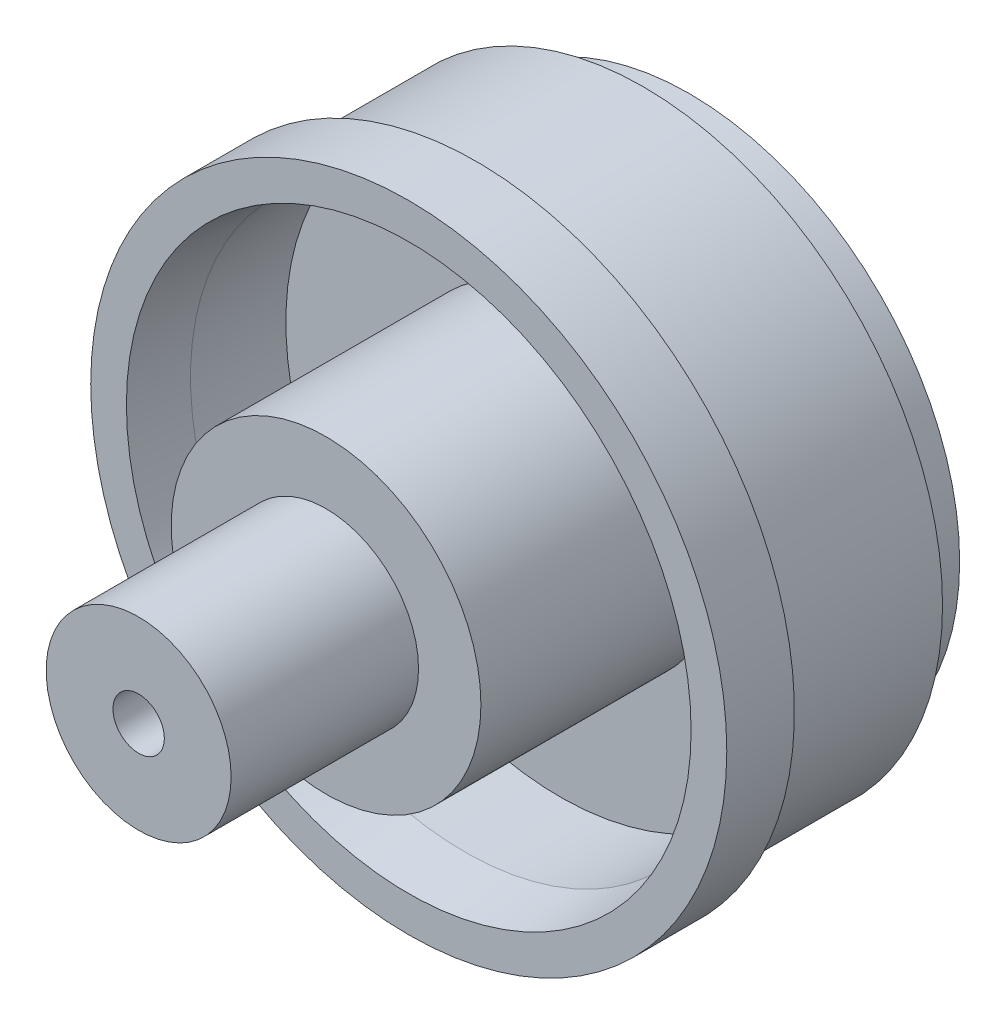
ISO-10303-21;
HEADER;
FILE_DESCRIPTION(('STEP AP214'),'2;1');
FILE_NAME('part.step','',(''),(''),'','','');
FILE_SCHEMA(('AUTOMOTIVE_DESIGN { 1 0 10303 214 1 1 1 1 }'));
ENDSEC;
DATA;
#1=APPLICATION_CONTEXT('core data for automotive mechanical design processes');
#2=APPLICATION_PROTOCOL_DEFINITION('international standard','automotive_design',2000,#1);
#3=PRODUCT_CONTEXT('',#1,'mechanical');
#4=PRODUCT('Part','Part','',(#3));
#5=PRODUCT_RELATED_PRODUCT_CATEGORY('part','',(#4));
#6=PRODUCT_DEFINITION_FORMATION('','',#4);
#7=PRODUCT_DEFINITION_CONTEXT('part definition',#1,'design');
#8=PRODUCT_DEFINITION('design','',#6,#7);
#9=PRODUCT_DEFINITION_SHAPE('','',#8);
#10=(LENGTH_UNIT() NAMED_UNIT(*) SI_UNIT(.MILLI.,.METRE.));
#11=(NAMED_UNIT(*) PLANE_ANGLE_UNIT() SI_UNIT($,.RADIAN.));
#12=(NAMED_UNIT(*) SI_UNIT($,.STERADIAN.) SOLID_ANGLE_UNIT());
#13=UNCERTAINTY_MEASURE_WITH_UNIT(LENGTH_MEASURE(1.E-05),#10,'distance_accuracy_value','');
#14=(GEOMETRIC_REPRESENTATION_CONTEXT(3) GLOBAL_UNCERTAINTY_ASSIGNED_CONTEXT((#13)) GLOBAL_UNIT_ASSIGNED_CONTEXT((#10,
#11,#12)) REPRESENTATION_CONTEXT('',''));
#15=CARTESIAN_POINT('',(0.,0.,0.));
#16=DIRECTION('',(0.,0.,1.));
#17=DIRECTION('',(1.,0.,0.));
#18=AXIS2_PLACEMENT_3D('',#15,#16,#17);
#19=CARTESIAN_POINT('',(0.,0.,32.9057));
#20=DIRECTION('',(0.,0.,-1.));
#21=DIRECTION('',(-1.,0.,0.));
#22=AXIS2_PLACEMENT_3D('',#19,#20,#21);
#23=CYLINDRICAL_SURFACE('',#22,46.228);
#24=CARTESIAN_POINT('',(0.,0.,32.9057));
#25=DIRECTION('',(0.,0.,-1.));
#26=DIRECTION('',(-1.,0.,0.));
#27=AXIS2_PLACEMENT_3D('',#24,#25,#26);
#28=CIRCLE('',#27,46.228);
#29=CARTESIAN_POINT('',(-46.228,0.,32.9057));
#30=VERTEX_POINT('',#29);
#31=EDGE_CURVE('E63',#30,#30,#28,.T.);
#32=ORIENTED_EDGE('',*,*,#31,.T.);
#33=EDGE_LOOP('',(#32));
#34=FACE_BOUND('',#33,.T.);
#35=CARTESIAN_POINT('',(0.,0.,7.112));
#36=DIRECTION('',(0.,0.,-1.));
#37=DIRECTION('',(-1.,0.,0.));
#38=AXIS2_PLACEMENT_3D('',#35,#36,#37);
#39=CIRCLE('',#38,46.228);
#40=CARTESIAN_POINT('',(-46.228,0.,7.112));
#41=VERTEX_POINT('',#40);
#42=EDGE_CURVE('E54',#41,#41,#39,.F.);
#43=ORIENTED_EDGE('',*,*,#42,.T.);
#44=EDGE_LOOP('',(#43));
#45=FACE_BOUND('',#44,.T.);
#46=ADVANCED_FACE('F36',(#34,#45),#23,.T.);
#47=CARTESIAN_POINT('',(0.,0.,56.134));
#48=DIRECTION('',(0.,0.,1.));
#49=DIRECTION('',(1.,0.,0.));
#50=AXIS2_PLACEMENT_3D('',#47,#48,#49);
#51=PLANE('',#50);
#52=CARTESIAN_POINT('',(0.,0.,56.134));
#53=DIRECTION('',(0.,0.,1.));
#54=DIRECTION('',(1.,0.,0.));
#55=AXIS2_PLACEMENT_3D('',#52,#53,#54);
#56=CIRCLE('',#55,14.2875);
#57=CARTESIAN_POINT('',(14.2875,0.,56.134));
#58=VERTEX_POINT('',#57);
#59=EDGE_CURVE('E69',#58,#58,#56,.T.);
#60=ORIENTED_EDGE('',*,*,#59,.F.);
#61=EDGE_LOOP('',(#60));
#62=FACE_BOUND('',#61,.T.);
#63=CARTESIAN_POINT('',(0.,0.,56.134));
#64=DIRECTION('',(0.,0.,1.));
#65=DIRECTION('',(1.,0.,0.));
#66=AXIS2_PLACEMENT_3D('',#63,#64,#65);
#67=CIRCLE('',#66,23.9268);
#68=CARTESIAN_POINT('',(23.9268,0.,56.134));
#69=VERTEX_POINT('',#68);
#70=EDGE_CURVE('E62',#69,#69,#67,.T.);
#71=ORIENTED_EDGE('',*,*,#70,.T.);
#72=EDGE_LOOP('',(#71));
#73=FACE_BOUND('',#72,.T.);
#74=ADVANCED_FACE('F115',(#62,#73),#51,.T.);
#75=CARTESIAN_POINT('',(0.,0.,85.09));
#76=DIRECTION('',(0.,0.,1.));
#77=DIRECTION('',(1.,0.,0.));
#78=AXIS2_PLACEMENT_3D('',#75,#76,#77);
#79=PLANE('',#78);
#80=CARTESIAN_POINT('',(0.,0.,85.09));
#81=DIRECTION('',(0.,0.,1.));
#82=DIRECTION('',(1.,0.,0.));
#83=AXIS2_PLACEMENT_3D('',#80,#81,#82);
#84=CIRCLE('',#83,3.96875);
#85=CARTESIAN_POINT('',(3.96875,0.,85.09));
#86=VERTEX_POINT('',#85);
#87=EDGE_CURVE('E51',#86,#86,#84,.T.);
#88=ORIENTED_EDGE('',*,*,#87,.F.);
#89=EDGE_LOOP('',(#88));
#90=FACE_BOUND('',#89,.T.);
#91=CARTESIAN_POINT('',(0.,0.,85.09));
#92=DIRECTION('',(0.,0.,1.));
#93=DIRECTION('',(1.,0.,0.));
#94=AXIS2_PLACEMENT_3D('',#91,#92,#93);
#95=CIRCLE('',#94,14.2875);
#96=CARTESIAN_POINT('',(14.2875,0.,85.09));
#97=VERTEX_POINT('',#96);
#98=EDGE_CURVE('E67',#97,#97,#95,.T.);
#99=ORIENTED_EDGE('',*,*,#98,.T.);
#100=EDGE_LOOP('',(#99));
#101=FACE_BOUND('',#100,.T.);
#102=ADVANCED_FACE('F121',(#90,#101),#79,.T.);
#103=CARTESIAN_POINT('',(0.,0.,58.42));
#104=DIRECTION('',(0.,0.,1.));
#105=DIRECTION('',(1.,0.,0.));
#106=AXIS2_PLACEMENT_3D('',#103,#104,#105);
#107=CYLINDRICAL_SURFACE('',#106,3.96875);
#108=CARTESIAN_POINT('',(0.,0.,58.42));
#109=DIRECTION('',(0.,0.,1.));
#110=DIRECTION('',(1.,0.,0.));
#111=AXIS2_PLACEMENT_3D('',#108,#109,#110);
#112=CIRCLE('',#111,3.96875);
#113=CARTESIAN_POINT('',(3.96875,0.,58.42));
#114=VERTEX_POINT('',#113);
#115=EDGE_CURVE('E47',#114,#114,#112,.T.);
#116=ORIENTED_EDGE('',*,*,#115,.F.);
#117=EDGE_LOOP('',(#116));
#118=FACE_BOUND('',#117,.T.);
#119=ORIENTED_EDGE('',*,*,#87,.T.);
#120=EDGE_LOOP('',(#119));
#121=FACE_BOUND('',#120,.T.);
#122=ADVANCED_FACE('F145',(#118,#121),#107,.F.);
#123=CARTESIAN_POINT('',(0.,0.,58.42));
#124=DIRECTION('',(0.,0.,1.));
#125=DIRECTION('',(1.,0.,0.));
#126=AXIS2_PLACEMENT_3D('',#123,#124,#125);
#127=PLANE('',#126);
#128=ORIENTED_EDGE('',*,*,#115,.T.);
#129=EDGE_LOOP('',(#128));
#130=FACE_BOUND('',#129,.T.);
#131=ADVANCED_FACE('F140',(#130),#127,.T.);
#132=CARTESIAN_POINT('',(0.,0.,56.134));
#133=DIRECTION('',(0.,0.,1.));
#134=DIRECTION('',(1.,0.,0.));
#135=AXIS2_PLACEMENT_3D('',#132,#133,#134);
#136=CYLINDRICAL_SURFACE('',#135,14.2875);
#137=ORIENTED_EDGE('',*,*,#59,.T.);
#138=EDGE_LOOP('',(#137));
#139=FACE_BOUND('',#138,.T.);
#140=ORIENTED_EDGE('',*,*,#98,.F.);
#141=EDGE_LOOP('',(#140));
#142=FACE_BOUND('',#141,.T.);
#143=ADVANCED_FACE('F136',(#139,#142),#136,.T.);
#144=CARTESIAN_POINT('',(0.,0.,43.3578));
#145=DIRECTION('',(0.,0.,1.));
#146=DIRECTION('',(1.,0.,0.));
#147=AXIS2_PLACEMENT_3D('',#144,#145,#146);
#148=CYLINDRICAL_SURFACE('',#147,23.9268);
#149=ORIENTED_EDGE('',*,*,#70,.F.);
#150=EDGE_LOOP('',(#149));
#151=FACE_BOUND('',#150,.T.);
#152=CARTESIAN_POINT('',(0.,0.,19.9898));
#153=DIRECTION('',(0.,0.,1.));
#154=DIRECTION('',(1.,0.,0.));
#155=AXIS2_PLACEMENT_3D('',#152,#153,#154);
#156=CIRCLE('',#155,23.9268);
#157=CARTESIAN_POINT('',(23.9268,0.,19.9898));
#158=VERTEX_POINT('',#157);
#159=EDGE_CURVE('E82',#158,#158,#156,.T.);
#160=ORIENTED_EDGE('',*,*,#159,.T.);
#161=EDGE_LOOP('',(#160));
#162=FACE_BOUND('',#161,.T.);
#163=ADVANCED_FACE('F134',(#151,#162),#148,.T.);
#164=CARTESIAN_POINT('',(0.,0.,19.9898));
#165=DIRECTION('',(0.,0.,1.));
#166=DIRECTION('',(1.,0.,0.));
#167=AXIS2_PLACEMENT_3D('',#164,#165,#166);
#168=CYLINDRICAL_SURFACE('',#167,42.3545);
#169=CARTESIAN_POINT('',(0.,0.,34.7217999999994));
#170=DIRECTION('',(0.,0.,1.));
#171=DIRECTION('',(1.,0.,0.));
#172=AXIS2_PLACEMENT_3D('',#169,#170,#171);
#173=CIRCLE('',#172,42.3545);
#174=CARTESIAN_POINT('',(42.3545,0.,34.7217999999994));
#175=VERTEX_POINT('',#174);
#176=EDGE_CURVE('E43',#175,#175,#173,.T.);
#177=ORIENTED_EDGE('',*,*,#176,.T.);
#178=EDGE_LOOP('',(#177));
#179=FACE_BOUND('',#178,.T.);
#180=CARTESIAN_POINT('',(0.,0.,19.9898));
#181=DIRECTION('',(0.,0.,1.));
#182=DIRECTION('',(1.,0.,0.));
#183=AXIS2_PLACEMENT_3D('',#180,#181,#182);
#184=CIRCLE('',#183,42.3545);
#185=CARTESIAN_POINT('',(42.3545,0.,19.9898));
#186=VERTEX_POINT('',#185);
#187=EDGE_CURVE('E79',#186,#186,#184,.T.);
#188=ORIENTED_EDGE('',*,*,#187,.F.);
#189=EDGE_LOOP('',(#188));
#190=FACE_BOUND('',#189,.T.);
#191=ADVANCED_FACE('F127',(#179,#190),#168,.F.);
#192=CARTESIAN_POINT('',(0.,0.,19.9898));
#193=DIRECTION('',(0.,0.,1.));
#194=DIRECTION('',(1.,0.,0.));
#195=AXIS2_PLACEMENT_3D('',#192,#193,#194);
#196=PLANE('',#195);
#197=ORIENTED_EDGE('',*,*,#159,.F.);
#198=EDGE_LOOP('',(#197));
#199=FACE_BOUND('',#198,.T.);
#200=ORIENTED_EDGE('',*,*,#187,.T.);
#201=EDGE_LOOP('',(#200));
#202=FACE_BOUND('',#201,.T.);
#203=ADVANCED_FACE('F132',(#199,#202),#196,.T.);
#204=CARTESIAN_POINT('',(0.,0.,32.9057));
#205=DIRECTION('',(0.,0.,-1.));
#206=DIRECTION('',(-1.,0.,0.));
#207=AXIS2_PLACEMENT_3D('',#204,#205,#206);
#208=PLANE('',#207);
#209=ORIENTED_EDGE('',*,*,#31,.F.);
#210=EDGE_LOOP('',(#209));
#211=FACE_BOUND('',#210,.T.);
#212=CARTESIAN_POINT('',(0.,0.,32.9057));
#213=DIRECTION('',(0.,0.,-1.));
#214=DIRECTION('',(-1.,0.,0.));
#215=AXIS2_PLACEMENT_3D('',#212,#213,#214);
#216=CIRCLE('',#215,49.1363);
#217=CARTESIAN_POINT('',(-49.1363,0.,32.9057));
#218=VERTEX_POINT('',#217);
#219=EDGE_CURVE('E59',#218,#218,#216,.T.);
#220=ORIENTED_EDGE('',*,*,#219,.T.);
#221=EDGE_LOOP('',(#220));
#222=FACE_BOUND('',#221,.T.);
#223=ADVANCED_FACE('F129',(#211,#222),#208,.T.);
#224=CARTESIAN_POINT('',(0.,0.,85.09));
#225=DIRECTION('',(0.,0.,-1.));
#226=DIRECTION('',(-1.,0.,0.));
#227=AXIS2_PLACEMENT_3D('',#224,#225,#226);
#228=CYLINDRICAL_SURFACE('',#227,49.1363);
#229=CARTESIAN_POINT('',(0.,0.,43.3578));
#230=DIRECTION('',(0.,0.,1.));
#231=DIRECTION('',(1.,0.,0.));
#232=AXIS2_PLACEMENT_3D('',#229,#230,#231);
#233=CIRCLE('',#232,49.1363);
#234=CARTESIAN_POINT('',(49.1363,0.,43.3578));
#235=VERTEX_POINT('',#234);
#236=EDGE_CURVE('E64',#235,#235,#233,.T.);
#237=ORIENTED_EDGE('',*,*,#236,.F.);
#238=EDGE_LOOP('',(#237));
#239=FACE_BOUND('',#238,.T.);
#240=ORIENTED_EDGE('',*,*,#219,.F.);
#241=EDGE_LOOP('',(#240));
#242=FACE_BOUND('',#241,.T.);
#243=ADVANCED_FACE('F110',(#239,#242),#228,.T.);
#244=CARTESIAN_POINT('',(0.,0.,43.3578));
#245=DIRECTION('',(0.,0.,1.));
#246=DIRECTION('',(1.,0.,0.));
#247=AXIS2_PLACEMENT_3D('',#244,#245,#246);
#248=PLANE('',#247);
#249=CARTESIAN_POINT('',(0.,0.,43.3578));
#250=DIRECTION('',(0.,0.,1.));
#251=DIRECTION('',(1.,0.,0.));
#252=AXIS2_PLACEMENT_3D('',#249,#250,#251);
#253=CIRCLE('',#252,43.6245000000001);
#254=CARTESIAN_POINT('',(43.6245000000001,0.,43.3578));
#255=VERTEX_POINT('',#254);
#256=EDGE_CURVE('E11',#255,#255,#253,.F.);
#257=ORIENTED_EDGE('',*,*,#256,.T.);
#258=EDGE_LOOP('',(#257));
#259=FACE_BOUND('',#258,.T.);
#260=ORIENTED_EDGE('',*,*,#236,.T.);
#261=EDGE_LOOP('',(#260));
#262=FACE_BOUND('',#261,.T.);
#263=ADVANCED_FACE('F101',(#259,#262),#248,.T.);
#264=CARTESIAN_POINT('',(0.,0.,7.112));
#265=DIRECTION('',(0.,0.,-1.));
#266=DIRECTION('',(-1.,0.,0.));
#267=AXIS2_PLACEMENT_3D('',#264,#265,#266);
#268=PLANE('',#267);
#269=ORIENTED_EDGE('',*,*,#42,.F.);
#270=EDGE_LOOP('',(#269));
#271=FACE_BOUND('',#270,.T.);
#272=CARTESIAN_POINT('',(0.,0.,7.112));
#273=DIRECTION('',(0.,0.,-1.));
#274=DIRECTION('',(-1.,0.,0.));
#275=AXIS2_PLACEMENT_3D('',#272,#273,#274);
#276=CIRCLE('',#275,41.7576);
#277=CARTESIAN_POINT('',(-41.7576,0.,7.112));
#278=VERTEX_POINT('',#277);
#279=EDGE_CURVE('E58',#278,#278,#276,.T.);
#280=ORIENTED_EDGE('',*,*,#279,.F.);
#281=EDGE_LOOP('',(#280));
#282=FACE_BOUND('',#281,.T.);
#283=ADVANCED_FACE('F99',(#271,#282),#268,.T.);
#284=CARTESIAN_POINT('',(0.,0.,7.112));
#285=DIRECTION('',(0.,0.,-1.));
#286=DIRECTION('',(-1.,0.,0.));
#287=AXIS2_PLACEMENT_3D('',#284,#285,#286);
#288=CYLINDRICAL_SURFACE('',#287,41.7576);
#289=ORIENTED_EDGE('',*,*,#279,.T.);
#290=EDGE_LOOP('',(#289));
#291=FACE_BOUND('',#290,.T.);
#292=CARTESIAN_POINT('',(0.,0.,0.));
#293=DIRECTION('',(0.,0.,-1.));
#294=DIRECTION('',(-1.,0.,0.));
#295=AXIS2_PLACEMENT_3D('',#292,#293,#294);
#296=CIRCLE('',#295,41.7576);
#297=CARTESIAN_POINT('',(-41.7576,0.,0.));
#298=VERTEX_POINT('',#297);
#299=EDGE_CURVE('E90',#298,#298,#296,.T.);
#300=ORIENTED_EDGE('',*,*,#299,.F.);
#301=EDGE_LOOP('',(#300));
#302=FACE_BOUND('',#301,.T.);
#303=ADVANCED_FACE('F96',(#291,#302),#288,.T.);
#304=CARTESIAN_POINT('',(0.,0.,50.8));
#305=DIRECTION('',(0.,0.,-1.));
#306=DIRECTION('',(-1.,0.,0.));
#307=AXIS2_PLACEMENT_3D('',#304,#305,#306);
#308=PLANE('',#307);
#309=CARTESIAN_POINT('',(0.,0.,50.8));
#310=DIRECTION('',(0.,0.,-1.));
#311=DIRECTION('',(-1.,0.,0.));
#312=AXIS2_PLACEMENT_3D('',#309,#310,#311);
#313=CIRCLE('',#312,19.177);
#314=CARTESIAN_POINT('',(-19.177,0.,50.8));
#315=VERTEX_POINT('',#314);
#316=EDGE_CURVE('E85',#315,#315,#313,.T.);
#317=ORIENTED_EDGE('',*,*,#316,.T.);
#318=EDGE_LOOP('',(#317));
#319=FACE_BOUND('',#318,.T.);
#320=ADVANCED_FACE('F108',(#319),#308,.T.);
#321=CARTESIAN_POINT('',(0.,0.,50.8));
#322=DIRECTION('',(0.,0.,-1.));
#323=DIRECTION('',(-1.,0.,0.));
#324=AXIS2_PLACEMENT_3D('',#321,#322,#323);
#325=CYLINDRICAL_SURFACE('',#324,19.177);
#326=ORIENTED_EDGE('',*,*,#316,.F.);
#327=EDGE_LOOP('',(#326));
#328=FACE_BOUND('',#327,.T.);
#329=CARTESIAN_POINT('',(0.,0.,0.));
#330=DIRECTION('',(0.,0.,-1.));
#331=DIRECTION('',(-1.,0.,0.));
#332=AXIS2_PLACEMENT_3D('',#329,#330,#331);
#333=CIRCLE('',#332,19.177);
#334=CARTESIAN_POINT('',(-19.177,0.,0.));
#335=VERTEX_POINT('',#334);
#336=EDGE_CURVE('E57',#335,#335,#333,.T.);
#337=ORIENTED_EDGE('',*,*,#336,.T.);
#338=EDGE_LOOP('',(#337));
#339=FACE_BOUND('',#338,.T.);
#340=ADVANCED_FACE('F155',(#328,#339),#325,.F.);
#341=CARTESIAN_POINT('',(0.,0.,0.));
#342=DIRECTION('',(0.,0.,1.));
#343=DIRECTION('',(1.,0.,0.));
#344=AXIS2_PLACEMENT_3D('',#341,#342,#343);
#345=PLANE('',#344);
#346=ORIENTED_EDGE('',*,*,#336,.F.);
#347=EDGE_LOOP('',(#346));
#348=FACE_BOUND('',#347,.T.);
#349=ORIENTED_EDGE('',*,*,#299,.T.);
#350=EDGE_LOOP('',(#349));
#351=FACE_BOUND('',#350,.T.);
#352=ADVANCED_FACE('F153',(#348,#351),#345,.F.);
#353=CARTESIAN_POINT('',(0.,0.,34.7217999999994));
#354=DIRECTION('',(0.,0.,1.));
#355=DIRECTION('',(1.,0.,0.));
#356=AXIS2_PLACEMENT_3D('',#353,#354,#355);
#357=CONICAL_SURFACE('',#356,42.3545,0.146012257711272);
#358=ORIENTED_EDGE('',*,*,#256,.F.);
#359=EDGE_LOOP('',(#358));
#360=FACE_BOUND('',#359,.T.);
#361=ORIENTED_EDGE('',*,*,#176,.F.);
#362=EDGE_LOOP('',(#361));
#363=FACE_BOUND('',#362,.T.);
#364=ADVANCED_FACE('F38',(#360,#363),#357,.F.);
#365=CLOSED_SHELL('',(#46,#74,#102,#122,#131,#143,#163,#191,#203,#223,#243,#263,#283,#303,#320,
#340,#352,#364));
#366=MANIFOLD_SOLID_BREP('B2',#365);
#367=ADVANCED_BREP_SHAPE_REPRESENTATION('',(#18,#366),#14);
#368=SHAPE_DEFINITION_REPRESENTATION(#9,#367);
ENDSEC;
END-ISO-10303-21;
